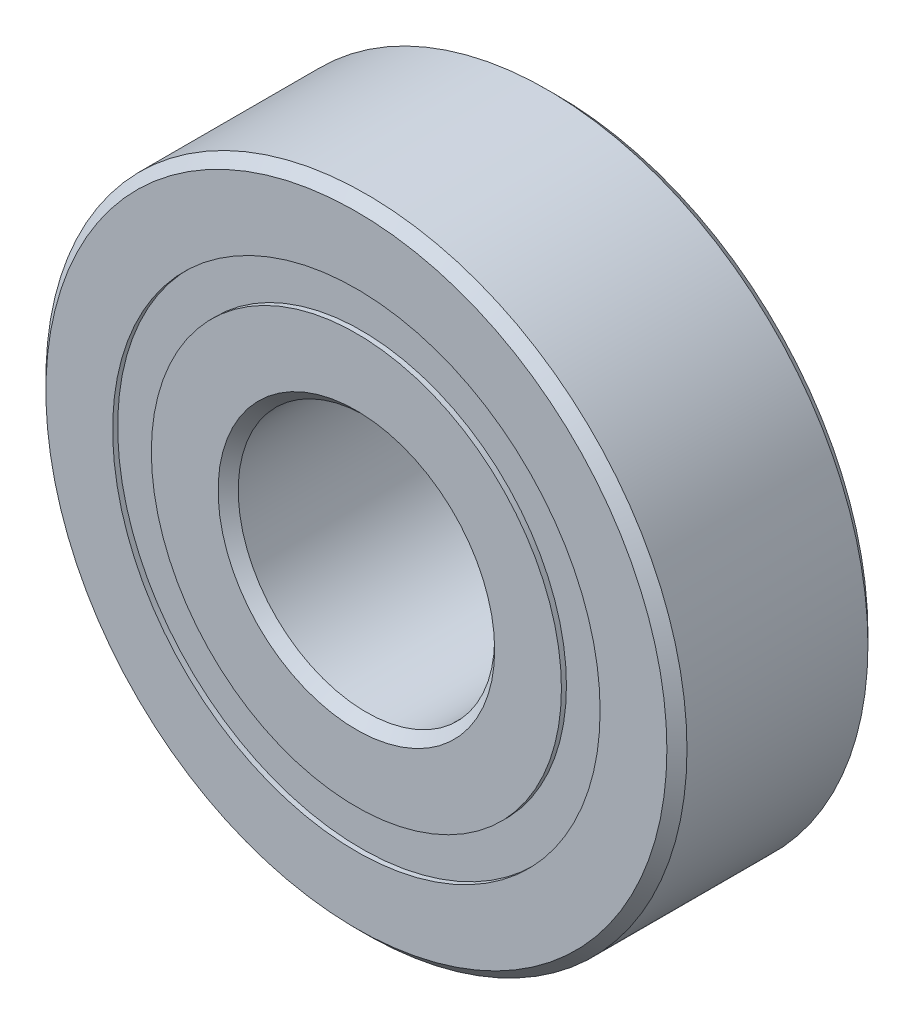
ISO-10303-21;
HEADER;
FILE_DESCRIPTION(('STEP AP214'),'2;1');
FILE_NAME('part.step','',(''),(''),'','','');
FILE_SCHEMA(('AUTOMOTIVE_DESIGN { 1 0 10303 214 1 1 1 1 }'));
ENDSEC;
DATA;
#1=APPLICATION_CONTEXT('core data for automotive mechanical design processes');
#2=APPLICATION_PROTOCOL_DEFINITION('international standard','automotive_design',2000,#1);
#3=PRODUCT_CONTEXT('',#1,'mechanical');
#4=PRODUCT('Part','Part','',(#3));
#5=PRODUCT_RELATED_PRODUCT_CATEGORY('part','',(#4));
#6=PRODUCT_DEFINITION_FORMATION('','',#4);
#7=PRODUCT_DEFINITION_CONTEXT('part definition',#1,'design');
#8=PRODUCT_DEFINITION('design','',#6,#7);
#9=PRODUCT_DEFINITION_SHAPE('','',#8);
#10=(LENGTH_UNIT() NAMED_UNIT(*) SI_UNIT(.MILLI.,.METRE.));
#11=(NAMED_UNIT(*) PLANE_ANGLE_UNIT() SI_UNIT($,.RADIAN.));
#12=(NAMED_UNIT(*) SI_UNIT($,.STERADIAN.) SOLID_ANGLE_UNIT());
#13=UNCERTAINTY_MEASURE_WITH_UNIT(LENGTH_MEASURE(1.E-05),#10,'distance_accuracy_value','');
#14=(GEOMETRIC_REPRESENTATION_CONTEXT(3) GLOBAL_UNCERTAINTY_ASSIGNED_CONTEXT((#13)) GLOBAL_UNIT_ASSIGNED_CONTEXT((#10,
#11,#12)) REPRESENTATION_CONTEXT('',''));
#15=CARTESIAN_POINT('',(0.,0.,0.));
#16=DIRECTION('',(0.,0.,1.));
#17=DIRECTION('',(1.,0.,0.));
#18=AXIS2_PLACEMENT_3D('',#15,#16,#17);
#19=CARTESIAN_POINT('',(0.,6.03522142857143,-2.36474));
#20=DIRECTION('',(0.,0.,1.));
#21=DIRECTION('',(1.,0.,0.));
#22=AXIS2_PLACEMENT_3D('',#19,#20,#21);
#23=PLANE('',#22);
#24=CARTESIAN_POINT('',(0.,0.,-2.36474));
#25=DIRECTION('',(0.,0.,1.));
#26=DIRECTION('',(1.,0.,0.));
#27=AXIS2_PLACEMENT_3D('',#24,#25,#26);
#28=CIRCLE('',#27,6.03522142857143);
#29=CARTESIAN_POINT('',(6.03522142857143,0.,-2.36474));
#30=VERTEX_POINT('',#29);
#31=EDGE_CURVE('E72',#30,#30,#28,.T.);
#32=ORIENTED_EDGE('',*,*,#31,.F.);
#33=EDGE_LOOP('',(#32));
#34=FACE_BOUND('',#33,.T.);
#35=CARTESIAN_POINT('',(0.,0.,-2.36474));
#36=DIRECTION('',(0.,0.,1.));
#37=DIRECTION('',(1.,0.,0.));
#38=AXIS2_PLACEMENT_3D('',#35,#36,#37);
#39=CIRCLE('',#38,5.07727857142857);
#40=CARTESIAN_POINT('',(5.07727857142857,0.,-2.36474));
#41=VERTEX_POINT('',#40);
#42=EDGE_CURVE('E11',#41,#41,#39,.T.);
#43=ORIENTED_EDGE('',*,*,#42,.T.);
#44=EDGE_LOOP('',(#43));
#45=FACE_BOUND('',#44,.T.);
#46=ADVANCED_FACE('F58',(#34,#45),#23,.F.);
#47=CARTESIAN_POINT('',(0.,0.,2.4892));
#48=DIRECTION('',(0.,0.,1.));
#49=DIRECTION('',(1.,0.,0.));
#50=AXIS2_PLACEMENT_3D('',#47,#48,#49);
#51=CYLINDRICAL_SURFACE('',#50,5.07727857142857);
#52=ORIENTED_EDGE('',*,*,#42,.F.);
#53=EDGE_LOOP('',(#52));
#54=FACE_BOUND('',#53,.T.);
#55=CARTESIAN_POINT('',(0.,0.,-1.20554465033679));
#56=DIRECTION('',(0.,0.,1.));
#57=DIRECTION('',(1.,0.,0.));
#58=AXIS2_PLACEMENT_3D('',#55,#56,#57);
#59=CIRCLE('',#58,5.07727857142857);
#60=CARTESIAN_POINT('',(5.07727857142857,0.,-1.20554465033679));
#61=VERTEX_POINT('',#60);
#62=EDGE_CURVE('E64',#61,#61,#59,.T.);
#63=ORIENTED_EDGE('',*,*,#62,.T.);
#64=EDGE_LOOP('',(#63));
#65=FACE_BOUND('',#64,.T.);
#66=ADVANCED_FACE('F81',(#54,#65),#51,.F.);
#67=CARTESIAN_POINT('',(0.,6.03522142857143,-1.20554465033679));
#68=DIRECTION('',(0.,0.,-1.));
#69=DIRECTION('',(-1.,0.,0.));
#70=AXIS2_PLACEMENT_3D('',#67,#68,#69);
#71=PLANE('',#70);
#72=ORIENTED_EDGE('',*,*,#62,.F.);
#73=EDGE_LOOP('',(#72));
#74=FACE_BOUND('',#73,.T.);
#75=CARTESIAN_POINT('',(0.,0.,-1.20554465033679));
#76=DIRECTION('',(0.,0.,1.));
#77=DIRECTION('',(1.,0.,0.));
#78=AXIS2_PLACEMENT_3D('',#75,#76,#77);
#79=CIRCLE('',#78,6.03522142857143);
#80=CARTESIAN_POINT('',(6.03522142857143,0.,-1.20554465033679));
#81=VERTEX_POINT('',#80);
#82=EDGE_CURVE('E68',#81,#81,#79,.T.);
#83=ORIENTED_EDGE('',*,*,#82,.T.);
#84=EDGE_LOOP('',(#83));
#85=FACE_BOUND('',#84,.T.);
#86=ADVANCED_FACE('F85',(#74,#85),#71,.F.);
#87=CARTESIAN_POINT('',(0.,0.,2.4892));
#88=DIRECTION('',(0.,0.,1.));
#89=DIRECTION('',(1.,0.,0.));
#90=AXIS2_PLACEMENT_3D('',#87,#88,#89);
#91=CYLINDRICAL_SURFACE('',#90,6.03522142857143);
#92=ORIENTED_EDGE('',*,*,#82,.F.);
#93=EDGE_LOOP('',(#92));
#94=FACE_BOUND('',#93,.T.);
#95=ORIENTED_EDGE('',*,*,#31,.T.);
#96=EDGE_LOOP('',(#95));
#97=FACE_BOUND('',#96,.T.);
#98=ADVANCED_FACE('F78',(#94,#97),#91,.T.);
#99=CLOSED_SHELL('',(#46,#66,#86,#98));
#100=MANIFOLD_SOLID_BREP('B2',#99);
#101=CARTESIAN_POINT('',(0.,6.03522142857143,2.36474));
#102=DIRECTION('',(0.,0.,-1.));
#103=DIRECTION('',(-1.,0.,0.));
#104=AXIS2_PLACEMENT_3D('',#101,#102,#103);
#105=PLANE('',#104);
#106=CARTESIAN_POINT('',(0.,0.,2.36474));
#107=DIRECTION('',(0.,0.,1.));
#108=DIRECTION('',(1.,0.,0.));
#109=AXIS2_PLACEMENT_3D('',#106,#107,#108);
#110=CIRCLE('',#109,5.07727857142857);
#111=CARTESIAN_POINT('',(5.07727857142857,0.,2.36474));
#112=VERTEX_POINT('',#111);
#113=EDGE_CURVE('E57',#112,#112,#110,.T.);
#114=ORIENTED_EDGE('',*,*,#113,.F.);
#115=EDGE_LOOP('',(#114));
#116=FACE_BOUND('',#115,.T.);
#117=CARTESIAN_POINT('',(0.,0.,2.36474));
#118=DIRECTION('',(0.,0.,1.));
#119=DIRECTION('',(1.,0.,0.));
#120=AXIS2_PLACEMENT_3D('',#117,#118,#119);
#121=CIRCLE('',#120,6.03522142857143);
#122=CARTESIAN_POINT('',(6.03522142857143,0.,2.36474));
#123=VERTEX_POINT('',#122);
#124=EDGE_CURVE('E148',#123,#123,#121,.T.);
#125=ORIENTED_EDGE('',*,*,#124,.T.);
#126=EDGE_LOOP('',(#125));
#127=FACE_BOUND('',#126,.T.);
#128=ADVANCED_FACE('F134',(#116,#127),#105,.F.);
#129=CARTESIAN_POINT('',(0.,0.,2.4892));
#130=DIRECTION('',(0.,0.,1.));
#131=DIRECTION('',(1.,0.,0.));
#132=AXIS2_PLACEMENT_3D('',#129,#130,#131);
#133=CYLINDRICAL_SURFACE('',#132,5.07727857142857);
#134=CARTESIAN_POINT('',(0.,0.,1.20554465033679));
#135=DIRECTION('',(0.,0.,1.));
#136=DIRECTION('',(1.,0.,0.));
#137=AXIS2_PLACEMENT_3D('',#134,#135,#136);
#138=CIRCLE('',#137,5.07727857142857);
#139=CARTESIAN_POINT('',(5.07727857142857,0.,1.20554465033679));
#140=VERTEX_POINT('',#139);
#141=EDGE_CURVE('E140',#140,#140,#138,.T.);
#142=ORIENTED_EDGE('',*,*,#141,.F.);
#143=EDGE_LOOP('',(#142));
#144=FACE_BOUND('',#143,.T.);
#145=ORIENTED_EDGE('',*,*,#113,.T.);
#146=EDGE_LOOP('',(#145));
#147=FACE_BOUND('',#146,.T.);
#148=ADVANCED_FACE('F163',(#144,#147),#133,.F.);
#149=CARTESIAN_POINT('',(0.,6.03522142857143,1.20554465033679));
#150=DIRECTION('',(0.,0.,1.));
#151=DIRECTION('',(1.,0.,0.));
#152=AXIS2_PLACEMENT_3D('',#149,#150,#151);
#153=PLANE('',#152);
#154=CARTESIAN_POINT('',(0.,0.,1.20554465033679));
#155=DIRECTION('',(0.,0.,1.));
#156=DIRECTION('',(1.,0.,0.));
#157=AXIS2_PLACEMENT_3D('',#154,#155,#156);
#158=CIRCLE('',#157,6.03522142857143);
#159=CARTESIAN_POINT('',(6.03522142857143,0.,1.20554465033679));
#160=VERTEX_POINT('',#159);
#161=EDGE_CURVE('E144',#160,#160,#158,.T.);
#162=ORIENTED_EDGE('',*,*,#161,.F.);
#163=EDGE_LOOP('',(#162));
#164=FACE_BOUND('',#163,.T.);
#165=ORIENTED_EDGE('',*,*,#141,.T.);
#166=EDGE_LOOP('',(#165));
#167=FACE_BOUND('',#166,.T.);
#168=ADVANCED_FACE('F158',(#164,#167),#153,.F.);
#169=CARTESIAN_POINT('',(0.,0.,2.4892));
#170=DIRECTION('',(0.,0.,1.));
#171=DIRECTION('',(1.,0.,0.));
#172=AXIS2_PLACEMENT_3D('',#169,#170,#171);
#173=CYLINDRICAL_SURFACE('',#172,6.03522142857143);
#174=ORIENTED_EDGE('',*,*,#124,.F.);
#175=EDGE_LOOP('',(#174));
#176=FACE_BOUND('',#175,.T.);
#177=ORIENTED_EDGE('',*,*,#161,.T.);
#178=EDGE_LOOP('',(#177));
#179=FACE_BOUND('',#178,.T.);
#180=ADVANCED_FACE('F155',(#176,#179),#173,.T.);
#181=CLOSED_SHELL('',(#128,#148,#168,#180));
#182=MANIFOLD_SOLID_BREP('B6',#181);
#183=CARTESIAN_POINT('',(-3.26588180805,4.49510067499584,0.));
#184=DIRECTION('',(0.,0.,1.));
#185=DIRECTION('',(-0.587785252292462,0.809016994374955,0.));
#186=AXIS2_PLACEMENT_3D('',#183,#184,#185);
#187=SPHERICAL_SURFACE('',#186,1.20554465033679);
#188=CARTESIAN_POINT('',(-3.26588180805,4.49510067499584,1.20554465033679));
#189=VERTEX_POINT('',#188);
#190=VERTEX_LOOP('',#189);
#191=FACE_BOUND('',#190,.T.);
#192=ADVANCED_FACE('F210',(#191),#187,.T.);
#193=CLOSED_SHELL('',(#192));
#194=MANIFOLD_SOLID_BREP('B52',#193);
#195=CARTESIAN_POINT('',(-5.28430776866493,1.71697567499586,0.));
#196=DIRECTION('',(0.,0.,1.));
#197=DIRECTION('',(-0.95105651629515,0.309016994374958,0.));
#198=AXIS2_PLACEMENT_3D('',#195,#196,#197);
#199=SPHERICAL_SURFACE('',#198,1.20554465033679);
#200=CARTESIAN_POINT('',(-5.28430776866493,1.71697567499586,1.20554465033679));
#201=VERTEX_POINT('',#200);
#202=VERTEX_LOOP('',#201);
#203=FACE_BOUND('',#202,.T.);
#204=ADVANCED_FACE('F233',(#203),#199,.T.);
#205=CLOSED_SHELL('',(#204));
#206=MANIFOLD_SOLID_BREP('B130',#205);
#207=CARTESIAN_POINT('',(-5.28430776866496,-1.71697567499575,0.));
#208=DIRECTION('',(0.,0.,1.));
#209=DIRECTION('',(-0.951056516295157,-0.309016994374938,0.));
#210=AXIS2_PLACEMENT_3D('',#207,#208,#209);
#211=SPHERICAL_SURFACE('',#210,1.20554465033679);
#212=CARTESIAN_POINT('',(-5.28430776866496,-1.71697567499575,1.20554465033679));
#213=VERTEX_POINT('',#212);
#214=VERTEX_LOOP('',#213);
#215=FACE_BOUND('',#214,.T.);
#216=ADVANCED_FACE('F257',(#215),#211,.T.);
#217=CLOSED_SHELL('',(#216));
#218=MANIFOLD_SOLID_BREP('B206',#217);
#219=CARTESIAN_POINT('',(-3.26588180805009,-4.49510067499577,0.));
#220=DIRECTION('',(0.,0.,1.));
#221=DIRECTION('',(-0.58778525229248,-0.809016994374942,0.));
#222=AXIS2_PLACEMENT_3D('',#219,#220,#221);
#223=SPHERICAL_SURFACE('',#222,1.20554465033679);
#224=CARTESIAN_POINT('',(-3.26588180805009,-4.49510067499577,1.20554465033679));
#225=VERTEX_POINT('',#224);
#226=VERTEX_LOOP('',#225);
#227=FACE_BOUND('',#226,.T.);
#228=ADVANCED_FACE('F284',(#227),#223,.T.);
#229=CLOSED_SHELL('',(#228));
#230=MANIFOLD_SOLID_BREP('B229',#229);
#231=CARTESIAN_POINT('',(0.,-5.55625,0.));
#232=DIRECTION('',(0.,0.,1.));
#233=DIRECTION('',(0.,-1.,0.));
#234=AXIS2_PLACEMENT_3D('',#231,#232,#233);
#235=SPHERICAL_SURFACE('',#234,1.20554465033679);
#236=CARTESIAN_POINT('',(0.,-5.55625,1.20554465033679));
#237=VERTEX_POINT('',#236);
#238=VERTEX_LOOP('',#237);
#239=FACE_BOUND('',#238,.T.);
#240=ADVANCED_FACE('F311',(#239),#235,.T.);
#241=CLOSED_SHELL('',(#240));
#242=MANIFOLD_SOLID_BREP('B253',#241);
#243=CARTESIAN_POINT('',(3.26588180805003,-4.49510067499582,0.));
#244=DIRECTION('',(0.,0.,1.));
#245=DIRECTION('',(0.587785252292469,-0.809016994374951,0.));
#246=AXIS2_PLACEMENT_3D('',#243,#244,#245);
#247=SPHERICAL_SURFACE('',#246,1.20554465033679);
#248=CARTESIAN_POINT('',(3.26588180805003,-4.49510067499582,1.20554465033679));
#249=VERTEX_POINT('',#248);
#250=VERTEX_LOOP('',#249);
#251=FACE_BOUND('',#250,.T.);
#252=ADVANCED_FACE('F337',(#251),#247,.T.);
#253=CLOSED_SHELL('',(#252));
#254=MANIFOLD_SOLID_BREP('B280',#253);
#255=CARTESIAN_POINT('',(5.28430776866494,-1.71697567499582,0.));
#256=DIRECTION('',(0.,0.,1.));
#257=DIRECTION('',(0.951056516295152,-0.309016994374952,0.));
#258=AXIS2_PLACEMENT_3D('',#255,#256,#257);
#259=SPHERICAL_SURFACE('',#258,1.20554465033679);
#260=CARTESIAN_POINT('',(5.28430776866494,-1.71697567499582,1.20554465033679));
#261=VERTEX_POINT('',#260);
#262=VERTEX_LOOP('',#261);
#263=FACE_BOUND('',#262,.T.);
#264=ADVANCED_FACE('F360',(#263),#259,.T.);
#265=CLOSED_SHELL('',(#264));
#266=MANIFOLD_SOLID_BREP('B307',#265);
#267=CARTESIAN_POINT('',(5.28430776866495,1.71697567499579,0.));
#268=DIRECTION('',(0.,0.,1.));
#269=DIRECTION('',(0.951056516295155,0.309016994374945,0.));
#270=AXIS2_PLACEMENT_3D('',#267,#268,#269);
#271=SPHERICAL_SURFACE('',#270,1.20554465033679);
#272=CARTESIAN_POINT('',(5.28430776866495,1.71697567499579,1.20554465033679));
#273=VERTEX_POINT('',#272);
#274=VERTEX_LOOP('',#273);
#275=FACE_BOUND('',#274,.T.);
#276=ADVANCED_FACE('F383',(#275),#271,.T.);
#277=CLOSED_SHELL('',(#276));
#278=MANIFOLD_SOLID_BREP('B333',#277);
#279=CARTESIAN_POINT('',(3.26588180805006,4.4951006749958,0.));
#280=DIRECTION('',(0.,0.,1.));
#281=DIRECTION('',(0.587785252292474,0.809016994374947,0.));
#282=AXIS2_PLACEMENT_3D('',#279,#280,#281);
#283=SPHERICAL_SURFACE('',#282,1.20554465033679);
#284=CARTESIAN_POINT('',(3.26588180805006,4.4951006749958,1.20554465033679));
#285=VERTEX_POINT('',#284);
#286=VERTEX_LOOP('',#285);
#287=FACE_BOUND('',#286,.T.);
#288=ADVANCED_FACE('F406',(#287),#283,.T.);
#289=CLOSED_SHELL('',(#288));
#290=MANIFOLD_SOLID_BREP('B356',#289);
#291=CARTESIAN_POINT('',(0.,5.55625,0.));
#292=DIRECTION('',(0.,0.,1.));
#293=DIRECTION('',(0.,1.,0.));
#294=AXIS2_PLACEMENT_3D('',#291,#292,#293);
#295=SPHERICAL_SURFACE('',#294,1.20554465033679);
#296=CARTESIAN_POINT('',(0.,5.55625,1.20554465033679));
#297=VERTEX_POINT('',#296);
#298=VERTEX_LOOP('',#297);
#299=FACE_BOUND('',#298,.T.);
#300=ADVANCED_FACE('F432',(#299),#295,.T.);
#301=CLOSED_SHELL('',(#300));
#302=MANIFOLD_SOLID_BREP('B379',#301);
#303=CARTESIAN_POINT('',(0.,5.07727857142857,2.4892));
#304=DIRECTION('',(0.,0.,-1.));
#305=DIRECTION('',(-1.,0.,0.));
#306=AXIS2_PLACEMENT_3D('',#303,#304,#305);
#307=PLANE('',#306);
#308=CARTESIAN_POINT('',(0.,0.,2.4892));
#309=DIRECTION('',(0.,0.,1.));
#310=DIRECTION('',(1.,0.,0.));
#311=AXIS2_PLACEMENT_3D('',#308,#309,#310);
#312=CIRCLE('',#311,3.42392);
#313=CARTESIAN_POINT('',(3.42392,0.,2.4892));
#314=VERTEX_POINT('',#313);
#315=EDGE_CURVE('E482',#314,#314,#312,.T.);
#316=ORIENTED_EDGE('',*,*,#315,.F.);
#317=EDGE_LOOP('',(#316));
#318=FACE_BOUND('',#317,.T.);
#319=CARTESIAN_POINT('',(0.,0.,2.4892));
#320=DIRECTION('',(0.,0.,1.));
#321=DIRECTION('',(1.,0.,0.));
#322=AXIS2_PLACEMENT_3D('',#319,#320,#321);
#323=CIRCLE('',#322,5.07727857142857);
#324=CARTESIAN_POINT('',(5.07727857142857,0.,2.4892));
#325=VERTEX_POINT('',#324);
#326=EDGE_CURVE('E431',#325,#325,#323,.T.);
#327=ORIENTED_EDGE('',*,*,#326,.T.);
#328=EDGE_LOOP('',(#327));
#329=FACE_BOUND('',#328,.T.);
#330=ADVANCED_FACE('F454',(#318,#329),#307,.F.);
#331=CARTESIAN_POINT('',(0.,0.,2.4892));
#332=DIRECTION('',(0.,0.,1.));
#333=DIRECTION('',(1.,0.,0.));
#334=AXIS2_PLACEMENT_3D('',#331,#332,#333);
#335=CYLINDRICAL_SURFACE('',#334,5.07727857142857);
#336=ORIENTED_EDGE('',*,*,#326,.F.);
#337=EDGE_LOOP('',(#336));
#338=FACE_BOUND('',#337,.T.);
#339=CARTESIAN_POINT('',(0.,0.,1.10631111111111));
#340=DIRECTION('',(0.,0.,1.));
#341=DIRECTION('',(1.,0.,0.));
#342=AXIS2_PLACEMENT_3D('',#339,#340,#341);
#343=CIRCLE('',#342,5.07727857142857);
#344=CARTESIAN_POINT('',(5.07727857142857,0.,1.10631111111111));
#345=VERTEX_POINT('',#344);
#346=EDGE_CURVE('E460',#345,#345,#343,.T.);
#347=ORIENTED_EDGE('',*,*,#346,.T.);
#348=EDGE_LOOP('',(#347));
#349=FACE_BOUND('',#348,.T.);
#350=ADVANCED_FACE('F489',(#338,#349),#335,.T.);
#351=CARTESIAN_POINT('',(0.,0.,0.));
#352=DIRECTION('',(0.,0.,1.));
#353=DIRECTION('',(1.,0.,0.));
#354=AXIS2_PLACEMENT_3D('',#351,#352,#353);
#355=TOROIDAL_SURFACE('',#354,5.55625,1.20554465033679);
#356=ORIENTED_EDGE('',*,*,#346,.F.);
#357=EDGE_LOOP('',(#356));
#358=FACE_BOUND('',#357,.T.);
#359=CARTESIAN_POINT('',(0.,0.,-1.10631111111111));
#360=DIRECTION('',(0.,0.,1.));
#361=DIRECTION('',(1.,0.,0.));
#362=AXIS2_PLACEMENT_3D('',#359,#360,#361);
#363=CIRCLE('',#362,5.07727857142857);
#364=CARTESIAN_POINT('',(5.07727857142857,0.,-1.10631111111111));
#365=VERTEX_POINT('',#364);
#366=EDGE_CURVE('E464',#365,#365,#363,.T.);
#367=ORIENTED_EDGE('',*,*,#366,.T.);
#368=EDGE_LOOP('',(#367));
#369=FACE_BOUND('',#368,.T.);
#370=ADVANCED_FACE('F493',(#358,#369),#355,.F.);
#371=CARTESIAN_POINT('',(0.,0.,2.4892));
#372=DIRECTION('',(0.,0.,1.));
#373=DIRECTION('',(1.,0.,0.));
#374=AXIS2_PLACEMENT_3D('',#371,#372,#373);
#375=CYLINDRICAL_SURFACE('',#374,5.07727857142857);
#376=ORIENTED_EDGE('',*,*,#366,.F.);
#377=EDGE_LOOP('',(#376));
#378=FACE_BOUND('',#377,.T.);
#379=CARTESIAN_POINT('',(0.,0.,-2.4892));
#380=DIRECTION('',(0.,0.,1.));
#381=DIRECTION('',(1.,0.,0.));
#382=AXIS2_PLACEMENT_3D('',#379,#380,#381);
#383=CIRCLE('',#382,5.07727857142857);
#384=CARTESIAN_POINT('',(5.07727857142857,0.,-2.4892));
#385=VERTEX_POINT('',#384);
#386=EDGE_CURVE('E468',#385,#385,#383,.T.);
#387=ORIENTED_EDGE('',*,*,#386,.T.);
#388=EDGE_LOOP('',(#387));
#389=FACE_BOUND('',#388,.T.);
#390=ADVANCED_FACE('F498',(#378,#389),#375,.T.);
#391=CARTESIAN_POINT('',(0.,3.42392,-2.4892));
#392=DIRECTION('',(0.,0.,1.));
#393=DIRECTION('',(1.,0.,0.));
#394=AXIS2_PLACEMENT_3D('',#391,#392,#393);
#395=PLANE('',#394);
#396=ORIENTED_EDGE('',*,*,#386,.F.);
#397=EDGE_LOOP('',(#396));
#398=FACE_BOUND('',#397,.T.);
#399=CARTESIAN_POINT('',(0.,0.,-2.4892));
#400=DIRECTION('',(0.,0.,1.));
#401=DIRECTION('',(1.,0.,0.));
#402=AXIS2_PLACEMENT_3D('',#399,#400,#401);
#403=CIRCLE('',#402,3.42392);
#404=CARTESIAN_POINT('',(3.42392,0.,-2.4892));
#405=VERTEX_POINT('',#404);
#406=EDGE_CURVE('E473',#405,#405,#403,.T.);
#407=ORIENTED_EDGE('',*,*,#406,.T.);
#408=EDGE_LOOP('',(#407));
#409=FACE_BOUND('',#408,.T.);
#410=ADVANCED_FACE('F504',(#398,#409),#395,.F.);
#411=CARTESIAN_POINT('',(0.,0.,-2.24028));
#412=DIRECTION('',(0.,0.,-1.));
#413=DIRECTION('',(-1.,0.,0.));
#414=AXIS2_PLACEMENT_3D('',#411,#412,#413);
#415=CONICAL_SURFACE('',#414,3.175,0.785398163397446);
#416=ORIENTED_EDGE('',*,*,#406,.F.);
#417=EDGE_LOOP('',(#416));
#418=FACE_BOUND('',#417,.T.);
#419=CARTESIAN_POINT('',(0.,0.,-2.24028));
#420=DIRECTION('',(0.,0.,1.));
#421=DIRECTION('',(1.,0.,0.));
#422=AXIS2_PLACEMENT_3D('',#419,#420,#421);
#423=CIRCLE('',#422,3.175);
#424=CARTESIAN_POINT('',(3.175,0.,-2.24028));
#425=VERTEX_POINT('',#424);
#426=EDGE_CURVE('E476',#425,#425,#423,.T.);
#427=ORIENTED_EDGE('',*,*,#426,.T.);
#428=EDGE_LOOP('',(#427));
#429=FACE_BOUND('',#428,.T.);
#430=ADVANCED_FACE('F508',(#418,#429),#415,.F.);
#431=CARTESIAN_POINT('',(0.,0.,2.4892));
#432=DIRECTION('',(0.,0.,1.));
#433=DIRECTION('',(1.,0.,0.));
#434=AXIS2_PLACEMENT_3D('',#431,#432,#433);
#435=CYLINDRICAL_SURFACE('',#434,3.175);
#436=ORIENTED_EDGE('',*,*,#426,.F.);
#437=EDGE_LOOP('',(#436));
#438=FACE_BOUND('',#437,.T.);
#439=CARTESIAN_POINT('',(0.,0.,2.24028));
#440=DIRECTION('',(0.,0.,1.));
#441=DIRECTION('',(1.,0.,0.));
#442=AXIS2_PLACEMENT_3D('',#439,#440,#441);
#443=CIRCLE('',#442,3.175);
#444=CARTESIAN_POINT('',(3.175,0.,2.24028));
#445=VERTEX_POINT('',#444);
#446=EDGE_CURVE('E479',#445,#445,#443,.T.);
#447=ORIENTED_EDGE('',*,*,#446,.T.);
#448=EDGE_LOOP('',(#447));
#449=FACE_BOUND('',#448,.T.);
#450=ADVANCED_FACE('F512',(#438,#449),#435,.F.);
#451=CARTESIAN_POINT('',(0.,0.,2.4892));
#452=DIRECTION('',(0.,0.,1.));
#453=DIRECTION('',(1.,0.,0.));
#454=AXIS2_PLACEMENT_3D('',#451,#452,#453);
#455=CONICAL_SURFACE('',#454,3.42392,0.785398163397449);
#456=ORIENTED_EDGE('',*,*,#446,.F.);
#457=EDGE_LOOP('',(#456));
#458=FACE_BOUND('',#457,.T.);
#459=ORIENTED_EDGE('',*,*,#315,.T.);
#460=EDGE_LOOP('',(#459));
#461=FACE_BOUND('',#460,.T.);
#462=ADVANCED_FACE('F486',(#458,#461),#455,.F.);
#463=CLOSED_SHELL('',(#330,#350,#370,#390,#410,#430,#450,#462));
#464=MANIFOLD_SOLID_BREP('B402',#463);
#465=CARTESIAN_POINT('',(0.,0.,2.24028));
#466=DIRECTION('',(0.,0.,-1.));
#467=DIRECTION('',(-1.,0.,0.));
#468=AXIS2_PLACEMENT_3D('',#465,#466,#467);
#469=CONICAL_SURFACE('',#468,7.9375,0.785398163397446);
#470=CARTESIAN_POINT('',(0.,0.,2.4892));
#471=DIRECTION('',(0.,0.,1.));
#472=DIRECTION('',(1.,0.,0.));
#473=AXIS2_PLACEMENT_3D('',#470,#471,#472);
#474=CIRCLE('',#473,7.68858);
#475=CARTESIAN_POINT('',(7.68858,0.,2.4892));
#476=VERTEX_POINT('',#475);
#477=EDGE_CURVE('E598',#476,#476,#474,.T.);
#478=ORIENTED_EDGE('',*,*,#477,.F.);
#479=EDGE_LOOP('',(#478));
#480=FACE_BOUND('',#479,.T.);
#481=CARTESIAN_POINT('',(0.,0.,2.24028));
#482=DIRECTION('',(0.,0.,1.));
#483=DIRECTION('',(1.,0.,0.));
#484=AXIS2_PLACEMENT_3D('',#481,#482,#483);
#485=CIRCLE('',#484,7.9375);
#486=CARTESIAN_POINT('',(7.9375,0.,2.24028));
#487=VERTEX_POINT('',#486);
#488=EDGE_CURVE('E453',#487,#487,#485,.T.);
#489=ORIENTED_EDGE('',*,*,#488,.T.);
#490=EDGE_LOOP('',(#489));
#491=FACE_BOUND('',#490,.T.);
#492=ADVANCED_FACE('F563',(#480,#491),#469,.T.);
#493=CARTESIAN_POINT('',(0.,0.,2.4892));
#494=DIRECTION('',(0.,0.,1.));
#495=DIRECTION('',(1.,0.,0.));
#496=AXIS2_PLACEMENT_3D('',#493,#494,#495);
#497=CYLINDRICAL_SURFACE('',#496,7.9375);
#498=ORIENTED_EDGE('',*,*,#488,.F.);
#499=EDGE_LOOP('',(#498));
#500=FACE_BOUND('',#499,.T.);
#501=CARTESIAN_POINT('',(0.,0.,-2.24028));
#502=DIRECTION('',(0.,0.,1.));
#503=DIRECTION('',(1.,0.,0.));
#504=AXIS2_PLACEMENT_3D('',#501,#502,#503);
#505=CIRCLE('',#504,7.9375);
#506=CARTESIAN_POINT('',(7.9375,0.,-2.24028));
#507=VERTEX_POINT('',#506);
#508=EDGE_CURVE('E570',#507,#507,#505,.T.);
#509=ORIENTED_EDGE('',*,*,#508,.T.);
#510=EDGE_LOOP('',(#509));
#511=FACE_BOUND('',#510,.T.);
#512=ADVANCED_FACE('F606',(#500,#511),#497,.T.);
#513=CARTESIAN_POINT('',(0.,0.,-2.4892));
#514=DIRECTION('',(0.,0.,1.));
#515=DIRECTION('',(1.,0.,0.));
#516=AXIS2_PLACEMENT_3D('',#513,#514,#515);
#517=CONICAL_SURFACE('',#516,7.68858,0.785398163397445);
#518=ORIENTED_EDGE('',*,*,#508,.F.);
#519=EDGE_LOOP('',(#518));
#520=FACE_BOUND('',#519,.T.);
#521=CARTESIAN_POINT('',(0.,0.,-2.4892));
#522=DIRECTION('',(0.,0.,1.));
#523=DIRECTION('',(1.,0.,0.));
#524=AXIS2_PLACEMENT_3D('',#521,#522,#523);
#525=CIRCLE('',#524,7.68858);
#526=CARTESIAN_POINT('',(7.68858,0.,-2.4892));
#527=VERTEX_POINT('',#526);
#528=EDGE_CURVE('E575',#527,#527,#525,.T.);
#529=ORIENTED_EDGE('',*,*,#528,.T.);
#530=EDGE_LOOP('',(#529));
#531=FACE_BOUND('',#530,.T.);
#532=ADVANCED_FACE('F610',(#520,#531),#517,.T.);
#533=CARTESIAN_POINT('',(0.,7.68858,-2.4892));
#534=DIRECTION('',(0.,0.,1.));
#535=DIRECTION('',(1.,0.,0.));
#536=AXIS2_PLACEMENT_3D('',#533,#534,#535);
#537=PLANE('',#536);
#538=ORIENTED_EDGE('',*,*,#528,.F.);
#539=EDGE_LOOP('',(#538));
#540=FACE_BOUND('',#539,.T.);
#541=CARTESIAN_POINT('',(0.,0.,-2.4892));
#542=DIRECTION('',(0.,0.,1.));
#543=DIRECTION('',(1.,0.,0.));
#544=AXIS2_PLACEMENT_3D('',#541,#542,#543);
#545=CIRCLE('',#544,6.03522142857143);
#546=CARTESIAN_POINT('',(6.03522142857143,0.,-2.4892));
#547=VERTEX_POINT('',#546);
#548=EDGE_CURVE('E580',#547,#547,#545,.T.);
#549=ORIENTED_EDGE('',*,*,#548,.T.);
#550=EDGE_LOOP('',(#549));
#551=FACE_BOUND('',#550,.T.);
#552=ADVANCED_FACE('F615',(#540,#551),#537,.F.);
#553=CARTESIAN_POINT('',(0.,0.,2.4892));
#554=DIRECTION('',(0.,0.,1.));
#555=DIRECTION('',(1.,0.,0.));
#556=AXIS2_PLACEMENT_3D('',#553,#554,#555);
#557=CYLINDRICAL_SURFACE('',#556,6.03522142857143);
#558=ORIENTED_EDGE('',*,*,#548,.F.);
#559=EDGE_LOOP('',(#558));
#560=FACE_BOUND('',#559,.T.);
#561=CARTESIAN_POINT('',(0.,0.,-1.10631111111111));
#562=DIRECTION('',(0.,0.,1.));
#563=DIRECTION('',(1.,0.,0.));
#564=AXIS2_PLACEMENT_3D('',#561,#562,#563);
#565=CIRCLE('',#564,6.03522142857143);
#566=CARTESIAN_POINT('',(6.03522142857143,0.,-1.10631111111111));
#567=VERTEX_POINT('',#566);
#568=EDGE_CURVE('E586',#567,#567,#565,.T.);
#569=ORIENTED_EDGE('',*,*,#568,.T.);
#570=EDGE_LOOP('',(#569));
#571=FACE_BOUND('',#570,.T.);
#572=ADVANCED_FACE('F621',(#560,#571),#557,.F.);
#573=CARTESIAN_POINT('',(0.,0.,0.));
#574=DIRECTION('',(0.,0.,1.));
#575=DIRECTION('',(1.,0.,0.));
#576=AXIS2_PLACEMENT_3D('',#573,#574,#575);
#577=TOROIDAL_SURFACE('',#576,5.55625,1.20554465033679);
#578=ORIENTED_EDGE('',*,*,#568,.F.);
#579=EDGE_LOOP('',(#578));
#580=FACE_BOUND('',#579,.T.);
#581=CARTESIAN_POINT('',(0.,0.,1.10631111111111));
#582=DIRECTION('',(0.,0.,1.));
#583=DIRECTION('',(1.,0.,0.));
#584=AXIS2_PLACEMENT_3D('',#581,#582,#583);
#585=CIRCLE('',#584,6.03522142857143);
#586=CARTESIAN_POINT('',(6.03522142857143,0.,1.10631111111111));
#587=VERTEX_POINT('',#586);
#588=EDGE_CURVE('E590',#587,#587,#585,.T.);
#589=ORIENTED_EDGE('',*,*,#588,.T.);
#590=EDGE_LOOP('',(#589));
#591=FACE_BOUND('',#590,.T.);
#592=ADVANCED_FACE('F625',(#580,#591),#577,.F.);
#593=CARTESIAN_POINT('',(0.,0.,2.4892));
#594=DIRECTION('',(0.,0.,1.));
#595=DIRECTION('',(1.,0.,0.));
#596=AXIS2_PLACEMENT_3D('',#593,#594,#595);
#597=CYLINDRICAL_SURFACE('',#596,6.03522142857143);
#598=ORIENTED_EDGE('',*,*,#588,.F.);
#599=EDGE_LOOP('',(#598));
#600=FACE_BOUND('',#599,.T.);
#601=CARTESIAN_POINT('',(0.,0.,2.4892));
#602=DIRECTION('',(0.,0.,1.));
#603=DIRECTION('',(1.,0.,0.));
#604=AXIS2_PLACEMENT_3D('',#601,#602,#603);
#605=CIRCLE('',#604,6.03522142857143);
#606=CARTESIAN_POINT('',(6.03522142857143,0.,2.4892));
#607=VERTEX_POINT('',#606);
#608=EDGE_CURVE('E594',#607,#607,#605,.T.);
#609=ORIENTED_EDGE('',*,*,#608,.T.);
#610=EDGE_LOOP('',(#609));
#611=FACE_BOUND('',#610,.T.);
#612=ADVANCED_FACE('F629',(#600,#611),#597,.F.);
#613=CARTESIAN_POINT('',(0.,7.68858,2.4892));
#614=DIRECTION('',(0.,0.,-1.));
#615=DIRECTION('',(-1.,0.,0.));
#616=AXIS2_PLACEMENT_3D('',#613,#614,#615);
#617=PLANE('',#616);
#618=ORIENTED_EDGE('',*,*,#608,.F.);
#619=EDGE_LOOP('',(#618));
#620=FACE_BOUND('',#619,.T.);
#621=ORIENTED_EDGE('',*,*,#477,.T.);
#622=EDGE_LOOP('',(#621));
#623=FACE_BOUND('',#622,.T.);
#624=ADVANCED_FACE('F603',(#620,#623),#617,.F.);
#625=CLOSED_SHELL('',(#492,#512,#532,#552,#572,#592,#612,#624));
#626=MANIFOLD_SOLID_BREP('B426',#625);
#627=ADVANCED_BREP_SHAPE_REPRESENTATION('',(#18,#100,#182,#194,#206,#218,#230,#242,#254,#266,
#278,#290,#302,#464,#626),#14);
#628=SHAPE_DEFINITION_REPRESENTATION(#9,#627);
ENDSEC;
END-ISO-10303-21;
